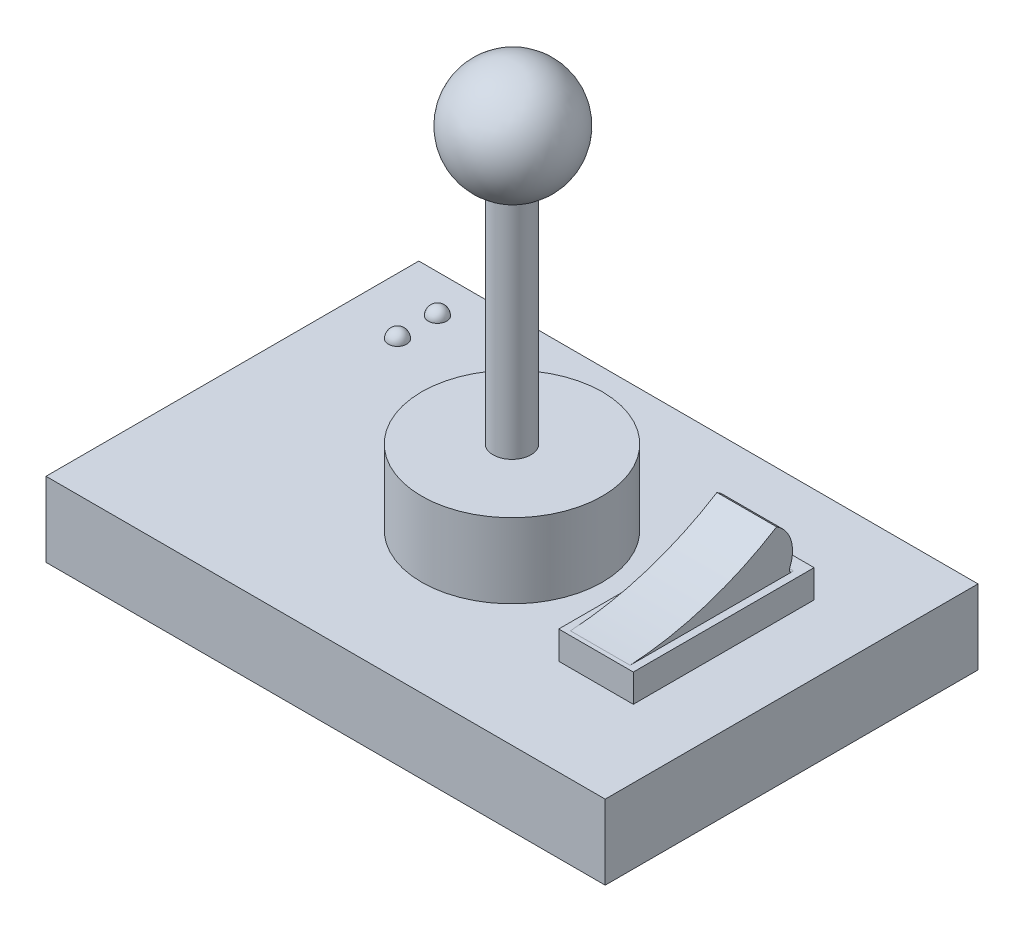
ISO-10303-21;
HEADER;
FILE_DESCRIPTION(('STEP AP214'),'2;1');
FILE_NAME('part.step','',(''),(''),'','','');
FILE_SCHEMA(('AUTOMOTIVE_DESIGN { 1 0 10303 214 1 1 1 1 }'));
ENDSEC;
DATA;
#1=APPLICATION_CONTEXT('core data for automotive mechanical design processes');
#2=APPLICATION_PROTOCOL_DEFINITION('international standard','automotive_design',2000,#1);
#3=PRODUCT_CONTEXT('',#1,'mechanical');
#4=PRODUCT('Part','Part','',(#3));
#5=PRODUCT_RELATED_PRODUCT_CATEGORY('part','',(#4));
#6=PRODUCT_DEFINITION_FORMATION('','',#4);
#7=PRODUCT_DEFINITION_CONTEXT('part definition',#1,'design');
#8=PRODUCT_DEFINITION('design','',#6,#7);
#9=PRODUCT_DEFINITION_SHAPE('','',#8);
#10=(LENGTH_UNIT() NAMED_UNIT(*) SI_UNIT(.MILLI.,.METRE.));
#11=(NAMED_UNIT(*) PLANE_ANGLE_UNIT() SI_UNIT($,.RADIAN.));
#12=(NAMED_UNIT(*) SI_UNIT($,.STERADIAN.) SOLID_ANGLE_UNIT());
#13=UNCERTAINTY_MEASURE_WITH_UNIT(LENGTH_MEASURE(1.E-05),#10,'distance_accuracy_value','');
#14=(GEOMETRIC_REPRESENTATION_CONTEXT(3) GLOBAL_UNCERTAINTY_ASSIGNED_CONTEXT((#13)) GLOBAL_UNIT_ASSIGNED_CONTEXT((#10,
#11,#12)) REPRESENTATION_CONTEXT('',''));
#15=CARTESIAN_POINT('',(0.,0.,0.));
#16=DIRECTION('',(0.,0.,1.));
#17=DIRECTION('',(1.,0.,0.));
#18=AXIS2_PLACEMENT_3D('',#15,#16,#17);
#19=CARTESIAN_POINT('',(0.,20.,0.));
#20=DIRECTION('',(0.,1.,0.));
#21=DIRECTION('',(0.,0.,1.));
#22=AXIS2_PLACEMENT_3D('',#19,#20,#21);
#23=PLANE('',#22);
#24=CARTESIAN_POINT('',(-59.7714063381106,20.,-29.0596155118016));
#25=DIRECTION('',(0.,1.,0.));
#26=DIRECTION('',(0.,0.,1.));
#27=AXIS2_PLACEMENT_3D('',#24,#25,#26);
#28=CIRCLE('',#27,2.48406479687552);
#29=CARTESIAN_POINT('',(-59.7714063381106,20.,-26.5755507149261));
#30=VERTEX_POINT('',#29);
#31=EDGE_CURVE('E52',#30,#30,#28,.F.);
#32=ORIENTED_EDGE('',*,*,#31,.T.);
#33=EDGE_LOOP('',(#32));
#34=FACE_BOUND('',#33,.T.);
#35=CARTESIAN_POINT('',(-59.7714063381106,20.,-39.76883352744));
#36=DIRECTION('',(0.,1.,0.));
#37=DIRECTION('',(0.,0.,1.));
#38=AXIS2_PLACEMENT_3D('',#35,#36,#37);
#39=CIRCLE('',#38,2.48406479687552);
#40=CARTESIAN_POINT('',(-59.7714063381106,20.,-37.2847687305645));
#41=VERTEX_POINT('',#40);
#42=EDGE_CURVE('E169',#41,#41,#39,.F.);
#43=ORIENTED_EDGE('',*,*,#42,.T.);
#44=EDGE_LOOP('',(#43));
#45=FACE_BOUND('',#44,.T.);
#46=CARTESIAN_POINT('',(0.,20.,0.));
#47=DIRECTION('',(0.,1.,0.));
#48=DIRECTION('',(0.,0.,1.));
#49=AXIS2_PLACEMENT_3D('',#46,#47,#48);
#50=CIRCLE('',#49,24.2391546507137);
#51=CARTESIAN_POINT('',(0.,20.,24.2391546507137));
#52=VERTEX_POINT('',#51);
#53=EDGE_CURVE('E326',#52,#52,#50,.F.);
#54=ORIENTED_EDGE('',*,*,#53,.T.);
#55=EDGE_LOOP('',(#54));
#56=FACE_BOUND('',#55,.T.);
#57=DIRECTION('',(0.,0.,1.));
#58=VECTOR('',#57,1.);
#59=CARTESIAN_POINT('',(-75.,20.,-50.));
#60=LINE('',#59,#58);
#61=CARTESIAN_POINT('',(-75.,20.,-50.));
#62=VERTEX_POINT('',#61);
#63=CARTESIAN_POINT('',(-75.,20.,50.));
#64=VERTEX_POINT('',#63);
#65=EDGE_CURVE('E340',#62,#64,#60,.T.);
#66=ORIENTED_EDGE('',*,*,#65,.T.);
#67=DIRECTION('',(1.,0.,0.));
#68=VECTOR('',#67,1.);
#69=CARTESIAN_POINT('',(-75.,20.,50.));
#70=LINE('',#69,#68);
#71=CARTESIAN_POINT('',(75.,20.,50.));
#72=VERTEX_POINT('',#71);
#73=EDGE_CURVE('E348',#64,#72,#70,.T.);
#74=ORIENTED_EDGE('',*,*,#73,.T.);
#75=DIRECTION('',(0.,0.,-1.));
#76=VECTOR('',#75,1.);
#77=CARTESIAN_POINT('',(75.,20.,-50.));
#78=LINE('',#77,#76);
#79=CARTESIAN_POINT('',(75.,20.,-50.));
#80=VERTEX_POINT('',#79);
#81=EDGE_CURVE('E352',#72,#80,#78,.T.);
#82=ORIENTED_EDGE('',*,*,#81,.T.);
#83=DIRECTION('',(-1.,0.,0.));
#84=VECTOR('',#83,1.);
#85=CARTESIAN_POINT('',(-75.,20.,-50.));
#86=LINE('',#85,#84);
#87=EDGE_CURVE('E334',#80,#62,#86,.T.);
#88=ORIENTED_EDGE('',*,*,#87,.T.);
#89=EDGE_LOOP('',(#66,#74,#82,#88));
#90=FACE_BOUND('',#89,.T.);
#91=DIRECTION('',(1.,0.,0.));
#92=VECTOR('',#91,1.);
#93=CARTESIAN_POINT('',(36.7473444831783,20.,24.2067764504516));
#94=LINE('',#93,#92);
#95=CARTESIAN_POINT('',(36.7473444831783,20.,24.2067764504516));
#96=VERTEX_POINT('',#95);
#97=CARTESIAN_POINT('',(56.7473444831783,20.,24.2067764504516));
#98=VERTEX_POINT('',#97);
#99=EDGE_CURVE('E379',#96,#98,#94,.T.);
#100=ORIENTED_EDGE('',*,*,#99,.F.);
#101=DIRECTION('',(0.,0.,1.));
#102=VECTOR('',#101,1.);
#103=CARTESIAN_POINT('',(36.7473444831783,20.,-24.2932235495484));
#104=LINE('',#103,#102);
#105=CARTESIAN_POINT('',(36.7473444831783,20.,-24.2932235495484));
#106=VERTEX_POINT('',#105);
#107=EDGE_CURVE('E381',#106,#96,#104,.T.);
#108=ORIENTED_EDGE('',*,*,#107,.F.);
#109=DIRECTION('',(-1.,0.,0.));
#110=VECTOR('',#109,1.);
#111=CARTESIAN_POINT('',(36.7473444831783,20.,-24.2932235495484));
#112=LINE('',#111,#110);
#113=CARTESIAN_POINT('',(56.7473444831783,20.,-24.2932235495484));
#114=VERTEX_POINT('',#113);
#115=EDGE_CURVE('E373',#114,#106,#112,.T.);
#116=ORIENTED_EDGE('',*,*,#115,.F.);
#117=DIRECTION('',(0.,0.,-1.));
#118=VECTOR('',#117,1.);
#119=CARTESIAN_POINT('',(56.7473444831783,20.,-24.2932235495484));
#120=LINE('',#119,#118);
#121=EDGE_CURVE('E376',#98,#114,#120,.T.);
#122=ORIENTED_EDGE('',*,*,#121,.F.);
#123=EDGE_LOOP('',(#100,#108,#116,#122));
#124=FACE_BOUND('',#123,.T.);
#125=ADVANCED_FACE('F44',(#34,#45,#56,#90,#124),#23,.T.);
#126=CARTESIAN_POINT('',(0.,100.,0.));
#127=DIRECTION('',(0.,-1.,0.));
#128=DIRECTION('',(0.,0.,-1.));
#129=AXIS2_PLACEMENT_3D('',#126,#127,#128);
#130=CYLINDRICAL_SURFACE('',#129,5.07390112110831);
#131=CARTESIAN_POINT('',(0.,40.,0.));
#132=DIRECTION('',(0.,1.,0.));
#133=DIRECTION('',(0.,0.,1.));
#134=AXIS2_PLACEMENT_3D('',#131,#132,#133);
#135=CIRCLE('',#134,5.07390112110831);
#136=CARTESIAN_POINT('',(0.,40.,5.07390112110831));
#137=VERTEX_POINT('',#136);
#138=EDGE_CURVE('E227',#137,#137,#135,.F.);
#139=ORIENTED_EDGE('',*,*,#138,.F.);
#140=EDGE_LOOP('',(#139));
#141=FACE_BOUND('',#140,.T.);
#142=CARTESIAN_POINT('',(-3.58601161184705,99.6185096445108,-3.58956728680245));
#143=CARTESIAN_POINT('',(-3.68687175268267,99.6201431007958,-3.48880849558666));
#144=CARTESIAN_POINT('',(-3.78346959181233,99.6218456039696,-3.38380799906421));
#145=CARTESIAN_POINT('',(-3.96751252370378,99.6253776556399,-3.16601387567986));
#146=CARTESIAN_POINT('',(-4.05495519847822,99.6272072374882,-3.05321820301226));
#147=CARTESIAN_POINT('',(-4.22010275951486,99.6309817569862,-2.82056304577515));
#148=CARTESIAN_POINT('',(-4.29779887927925,99.6329267962001,-2.7006973425312));
#149=CARTESIAN_POINT('',(-4.44283839587438,99.6369177988738,-2.45479975993668));
#150=CARTESIAN_POINT('',(-4.51017799522705,99.6389637989921,-2.32876564100565));
#151=CARTESIAN_POINT('',(-4.63393783645028,99.6431398299573,-2.07157934754588));
#152=CARTESIAN_POINT('',(-4.69036731073871,99.6452697879029,-1.94043161423496));
#153=CARTESIAN_POINT('',(-4.79199617398492,99.6496011331331,-1.67380040562698));
#154=CARTESIAN_POINT('',(-4.83719141496824,99.6518025464626,-1.53831534965615));
#155=CARTESIAN_POINT('',(-4.9159790891903,99.6562591037886,-1.26410422485947));
#156=CARTESIAN_POINT('',(-4.94957867242778,99.6585142137547,-1.12538020975776));
#157=CARTESIAN_POINT('',(-5.00498547174345,99.6630643632609,-0.845544205194316));
#158=CARTESIAN_POINT('',(-5.02678833088156,99.6653594172311,-0.704431353268987));
#159=CARTESIAN_POINT('',(-5.05842482158717,99.669971931634,-0.420897939488266));
#160=CARTESIAN_POINT('',(-5.06826073432763,99.6722893877113,-0.278477632080524));
#161=CARTESIAN_POINT('',(-5.07590250871906,99.6769315502863,0.00673796194253405));
#162=CARTESIAN_POINT('',(-5.07370392673301,99.6792562591453,0.149533367605019));
#163=CARTESIAN_POINT('',(-5.05728470044146,99.6838947746539,0.434384251114937));
#164=CARTESIAN_POINT('',(-5.04306801673115,99.6862085846428,0.576439957216208));
#165=CARTESIAN_POINT('',(-5.00271147121268,99.6908104518568,0.85890140627375));
#166=CARTESIAN_POINT('',(-4.9765672090689,99.693098499258,0.999306520665425));
#167=CARTESIAN_POINT('',(-4.91255067419148,99.6976308533971,1.27736601649463));
#168=CARTESIAN_POINT('',(-4.87468256497724,99.6998751753629,1.41502135602126));
#169=CARTESIAN_POINT('',(-4.78747058772202,99.7043056651591,1.68670184348221));
#170=CARTESIAN_POINT('',(-4.73812248776304,99.7064918112119,1.82072563231132));
#171=CARTESIAN_POINT('',(-4.62832005930795,99.71078880638,2.08409758655086));
#172=CARTESIAN_POINT('',(-4.56786985975261,99.7128996831411,2.21344746888403));
#173=CARTESIAN_POINT('',(-4.43629081072538,99.7170320391798,2.4666146026853));
#174=CARTESIAN_POINT('',(-4.36515802714082,99.7190534851659,2.59042979398307));
#175=CARTESIAN_POINT('',(-4.13650219649437,99.7249596534871,2.95211293445568));
#176=CARTESIAN_POINT('',(-3.96359641523021,99.7286910959837,3.18051812160724));
#177=CARTESIAN_POINT('',(-3.58197243964958,99.7356270564313,3.6049281424812));
#178=CARTESIAN_POINT('',(-3.37325433028268,99.7388315756323,3.80093305305735));
#179=CARTESIAN_POINT('',(-2.92586681367379,99.7446240420185,4.15513150009396));
#180=CARTESIAN_POINT('',(-2.68720085560756,99.7472120601086,4.31332938480849));
#181=CARTESIAN_POINT('',(-2.18669713679771,99.7516966256811,4.58740141141139));
#182=CARTESIAN_POINT('',(-1.92485936832683,99.7535931729329,4.70327553918567));
#183=CARTESIAN_POINT('',(-1.3854747214148,99.75664003726,4.88940805636402));
#184=CARTESIAN_POINT('',(-1.10792985974053,99.7577904499025,4.95967228762768));
#185=CARTESIAN_POINT('',(-0.544981794515749,99.7593121311575,5.05260884158343));
#186=CARTESIAN_POINT('',(-0.259578598546589,99.7596834005217,5.07528121018823));
#187=CARTESIAN_POINT('',(0.31095960339358,99.7596360736524,5.07239095342274));
#188=CARTESIAN_POINT('',(0.596094629728464,99.7592175432266,5.04683234675089));
#189=CARTESIAN_POINT('',(1.15802598483791,99.7576028480743,4.94821398714321));
#190=CARTESIAN_POINT('',(1.43482231373644,99.7564066833594,4.87515423491358));
#191=CARTESIAN_POINT('',(1.97221888152086,99.7532712837887,4.68360931697726));
#192=CARTESIAN_POINT('',(2.23281915210613,99.7513320503875,4.56512424018158));
#193=CARTESIAN_POINT('',(2.7304284148868,99.7467664859592,4.28609397743544));
#194=CARTESIAN_POINT('',(2.96743740030826,99.7441401547349,4.125548779408));
#195=CARTESIAN_POINT('',(3.41115719902546,99.7382758245097,3.76694267038221));
#196=CARTESIAN_POINT('',(3.6178655726645,99.7350377763043,3.56887874149938));
#197=CARTESIAN_POINT('',(3.99509702712315,99.7280432632931,3.14086721504558));
#198=CARTESIAN_POINT('',(4.16562008239599,99.7242867981212,2.91091959496496));
#199=CARTESIAN_POINT('',(4.46566336606378,99.7163626892163,2.42563700838792));
#200=CARTESIAN_POINT('',(4.59517838402273,99.7121949933209,2.17029882120576));
#201=CARTESIAN_POINT('',(4.80950251960433,99.7035680655002,1.64150750232241));
#202=CARTESIAN_POINT('',(4.89431161196478,99.6991088334102,1.36805436038501));
#203=CARTESIAN_POINT('',(5.01682617397341,99.6900255045677,0.810761404316948));
#204=CARTESIAN_POINT('',(5.05452613021363,99.6854013885832,0.526920378442909));
#205=CARTESIAN_POINT('',(5.08173410986365,99.6761203203773,-0.0430622457612098));
#206=CARTESIAN_POINT('',(5.07124209329043,99.6714633681288,-0.329203845999791));
#207=CARTESIAN_POINT('',(5.0023645878778,99.6622484872234,-0.89567932443103));
#208=CARTESIAN_POINT('',(4.94397640439181,99.6576905641528,-1.17601287495201));
#209=CARTESIAN_POINT('',(4.78094829502334,99.6488027958474,-1.72290587828733));
#210=CARTESIAN_POINT('',(4.6763084193486,99.644472950365,-1.98946534605354));
#211=CARTESIAN_POINT('',(4.42379068882093,99.6361641304893,-2.50120125987774));
#212=CARTESIAN_POINT('',(4.27591411404985,99.6321851457128,-2.74637833871176));
#213=CARTESIAN_POINT('',(3.94096309657253,99.6246878538731,-3.20852042217139));
#214=CARTESIAN_POINT('',(3.75388860149279,99.6211695474254,-3.42548538910134));
#215=CARTESIAN_POINT('',(3.44819380860763,99.61631575437,-3.72490087392714));
#216=CARTESIAN_POINT('',(3.34205743391786,99.6147677862755,-3.82040739204841));
#217=CARTESIAN_POINT('',(3.1221290880893,99.6118227695874,-4.0021358633288));
#218=CARTESIAN_POINT('',(3.00833995839066,99.6104256654752,-4.08836123195835));
#219=CARTESIAN_POINT('',(2.77386480153252,99.6077917068032,-4.25094320381142));
#220=CARTESIAN_POINT('',(2.65317623249743,99.6065549118596,-4.32729613562094));
#221=CARTESIAN_POINT('',(2.40583713873899,99.6042510973497,-4.46953704809989));
#222=CARTESIAN_POINT('',(2.27918883192778,99.6031840152624,-4.53542888255016));
#223=CARTESIAN_POINT('',(2.02075761936959,99.6012263438165,-4.65632562162671));
#224=CARTESIAN_POINT('',(1.88897338887605,99.6003358003591,-4.71132769483336));
#225=CARTESIAN_POINT('',(1.62128758297268,99.5987380723651,-4.81001455611312));
#226=CARTESIAN_POINT('',(1.48538754594211,99.598030820241,-4.85370351581243));
#227=CARTESIAN_POINT('',(1.21034442113455,99.5968039931488,-4.92949225607468));
#228=CARTESIAN_POINT('',(1.07120027965252,99.5962844800897,-4.96158821372204));
#229=CARTESIAN_POINT('',(0.790753788636147,99.595437248899,-5.01393269485669));
#230=CARTESIAN_POINT('',(0.649452254937331,99.5951094600227,-5.03418558834793));
#231=CARTESIAN_POINT('',(0.365621759326076,99.594647632922,-5.06272062559922));
#232=CARTESIAN_POINT('',(0.223092599467788,99.594513626555,-5.07100080106753));
#233=CARTESIAN_POINT('',(-0.0621039471469259,99.5944404166088,-5.07552436786089));
#234=CARTESIAN_POINT('',(-0.204771263486815,99.5945011411625,-5.07177219982455));
#235=CARTESIAN_POINT('',(-0.489371009010804,99.5948169096283,-5.05226142617352));
#236=CARTESIAN_POINT('',(-0.631302929776499,99.5950720735575,-5.03649540504196));
#237=CARTESIAN_POINT('',(-0.913281009654119,99.5957749471684,-4.99306843412208));
#238=CARTESIAN_POINT('',(-1.05332784445368,99.596222585856,-4.96541187014173));
#239=CARTESIAN_POINT('',(-1.3307072660641,99.5973077125712,-4.89837375973215));
#240=CARTESIAN_POINT('',(-1.46803754100859,99.5979453554612,-4.85898264909522));
#241=CARTESIAN_POINT('',(-1.73883780098327,99.5994056136238,-4.76878141585154));
#242=CARTESIAN_POINT('',(-1.8723091788542,99.6002281611916,-4.71797547291945));
#243=CARTESIAN_POINT('',(-2.13437996498477,99.6020518164495,-4.60534649252495));
#244=CARTESIAN_POINT('',(-2.26298360879523,99.6030527643669,-4.54353331303294));
#245=CARTESIAN_POINT('',(-2.51448915196939,99.6052263103334,-4.40932345819229));
#246=CARTESIAN_POINT('',(-2.63739254235664,99.6063988631584,-4.33692957125722));
#247=CARTESIAN_POINT('',(-2.90642981250973,99.6092198306177,-4.16278651327073));
#248=CARTESIAN_POINT('',(-3.05074633594714,99.6109140875207,-4.05821313964566));
#249=CARTESIAN_POINT('',(-3.32759252235291,99.6145395884219,-3.83448498937437));
#250=CARTESIAN_POINT('',(-3.46012218542245,99.6164708324181,-3.71533021285332));
#251=CARTESIAN_POINT('',(-3.58601161184705,99.6185096445108,-3.58956728680245));
#252=B_SPLINE_CURVE_WITH_KNOTS('',3,(#142,#143,#144,#145,#146,#147,#148,#149,#150,#151,#152,
#153,#154,#155,#156,#157,#158,#159,#160,#161,#162,#163,#164,#165,#166,#167,#168,#169,#170,#171,
#172,#173,#174,#175,#176,#177,#178,#179,#180,#181,#182,#183,#184,#185,#186,#187,#188,#189,#190,
#191,#192,#193,#194,#195,#196,#197,#198,#199,#200,#201,#202,#203,#204,#205,#206,#207,#208,#209,
#210,#211,#212,#213,#214,#215,#216,#217,#218,#219,#220,#221,#222,#223,#224,#225,#226,#227,#228,
#229,#230,#231,#232,#233,#234,#235,#236,#237,#238,#239,#240,#241,#242,#243,#244,#245,#246,#247,
#248,#249,#250,#251),.UNSPECIFIED.,.T.,.F.,(4,2,2,2,2,2,2,2,2,2,2,2,2,2,2,2,2,2,2,2,2,2,2,2,2,2,
2,2,2,2,2,2,2,2,2,2,2,2,2,2,2,2,2,2,2,2,2,2,2,2,2,2,2,2,4),(0.,0.427570992025448,
0.855254627250629,1.28332022379979,1.71154240902808,2.13940062058382,2.56741657476938,
2.99516813650237,3.42307757409522,3.85090542960255,4.27889126763909,4.70673611684238,
5.13473893484442,5.56258992914157,5.990598894607,6.41844900200093,6.84645706340693,
7.70151097712757,8.55656286262333,9.41151635968564,10.2664701418567,11.1213143972283,
11.9761578279162,12.8309300345359,13.6857022284479,14.5404727493225,15.3952435156325,
16.2500830661364,17.1049232201535,17.9598719456728,18.8148211543017,19.6698704123652,
20.5249203798305,21.3800184558536,22.2351156036418,23.0901874376677,23.9452604141877,
24.3732124443687,24.8010064455196,25.22895908218,25.6567536969998,26.0846593959773,
26.5124070825053,26.9402956948764,27.3680263196901,27.7958272546018,28.2234703241162,
28.6513775691365,29.0791271164694,29.5072262581439,29.9351689010302,30.3627301928795,
30.7901790087781,31.3238553149775,31.8575316165959),.UNSPECIFIED.);
#253=CARTESIAN_POINT('',(-3.58601161184705,99.6185096445108,-3.58956728680245));
#254=VERTEX_POINT('',#253);
#255=EDGE_CURVE('E219',#254,#254,#252,.T.);
#256=ORIENTED_EDGE('',*,*,#255,.F.);
#257=EDGE_LOOP('',(#256));
#258=FACE_BOUND('',#257,.T.);
#259=ADVANCED_FACE('F215',(#141,#258),#130,.T.);
#260=CARTESIAN_POINT('',(-75.,20.,-50.));
#261=DIRECTION('',(1.,0.,0.));
#262=DIRECTION('',(0.,0.,-1.));
#263=AXIS2_PLACEMENT_3D('',#260,#261,#262);
#264=PLANE('',#263);
#265=DIRECTION('',(0.,0.,1.));
#266=VECTOR('',#265,1.);
#267=CARTESIAN_POINT('',(-75.,0.,-50.));
#268=LINE('',#267,#266);
#269=CARTESIAN_POINT('',(-75.,0.,-50.));
#270=VERTEX_POINT('',#269);
#271=CARTESIAN_POINT('',(-75.,0.,50.));
#272=VERTEX_POINT('',#271);
#273=EDGE_CURVE('E319',#270,#272,#268,.T.);
#274=ORIENTED_EDGE('',*,*,#273,.T.);
#275=DIRECTION('',(0.,-1.,0.));
#276=VECTOR('',#275,1.);
#277=CARTESIAN_POINT('',(-75.,20.,50.));
#278=LINE('',#277,#276);
#279=EDGE_CURVE('E226',#64,#272,#278,.T.);
#280=ORIENTED_EDGE('',*,*,#279,.F.);
#281=ORIENTED_EDGE('',*,*,#65,.F.);
#282=DIRECTION('',(0.,-1.,0.));
#283=VECTOR('',#282,1.);
#284=CARTESIAN_POINT('',(-75.,20.,-50.));
#285=LINE('',#284,#283);
#286=EDGE_CURVE('E323',#62,#270,#285,.T.);
#287=ORIENTED_EDGE('',*,*,#286,.T.);
#288=EDGE_LOOP('',(#274,#280,#281,#287));
#289=FACE_BOUND('',#288,.T.);
#290=ADVANCED_FACE('F291',(#289),#264,.F.);
#291=CARTESIAN_POINT('',(-75.,20.,50.));
#292=DIRECTION('',(0.,0.,-1.));
#293=DIRECTION('',(-1.,0.,0.));
#294=AXIS2_PLACEMENT_3D('',#291,#292,#293);
#295=PLANE('',#294);
#296=DIRECTION('',(1.,0.,0.));
#297=VECTOR('',#296,1.);
#298=CARTESIAN_POINT('',(-75.,0.,50.));
#299=LINE('',#298,#297);
#300=CARTESIAN_POINT('',(75.,0.,50.));
#301=VERTEX_POINT('',#300);
#302=EDGE_CURVE('E325',#272,#301,#299,.T.);
#303=ORIENTED_EDGE('',*,*,#302,.T.);
#304=DIRECTION('',(0.,-1.,0.));
#305=VECTOR('',#304,1.);
#306=CARTESIAN_POINT('',(75.,20.,50.));
#307=LINE('',#306,#305);
#308=EDGE_CURVE('E345',#72,#301,#307,.T.);
#309=ORIENTED_EDGE('',*,*,#308,.F.);
#310=ORIENTED_EDGE('',*,*,#73,.F.);
#311=ORIENTED_EDGE('',*,*,#279,.T.);
#312=EDGE_LOOP('',(#303,#309,#310,#311));
#313=FACE_BOUND('',#312,.T.);
#314=ADVANCED_FACE('F307',(#313),#295,.F.);
#315=CARTESIAN_POINT('',(75.,20.,-50.));
#316=DIRECTION('',(-1.,0.,0.));
#317=DIRECTION('',(0.,0.,1.));
#318=AXIS2_PLACEMENT_3D('',#315,#316,#317);
#319=PLANE('',#318);
#320=DIRECTION('',(0.,0.,-1.));
#321=VECTOR('',#320,1.);
#322=CARTESIAN_POINT('',(75.,0.,-50.));
#323=LINE('',#322,#321);
#324=CARTESIAN_POINT('',(75.,0.,-50.));
#325=VERTEX_POINT('',#324);
#326=EDGE_CURVE('E328',#301,#325,#323,.T.);
#327=ORIENTED_EDGE('',*,*,#326,.T.);
#328=DIRECTION('',(0.,-1.,0.));
#329=VECTOR('',#328,1.);
#330=CARTESIAN_POINT('',(75.,20.,-50.));
#331=LINE('',#330,#329);
#332=EDGE_CURVE('E342',#80,#325,#331,.T.);
#333=ORIENTED_EDGE('',*,*,#332,.F.);
#334=ORIENTED_EDGE('',*,*,#81,.F.);
#335=ORIENTED_EDGE('',*,*,#308,.T.);
#336=EDGE_LOOP('',(#327,#333,#334,#335));
#337=FACE_BOUND('',#336,.T.);
#338=ADVANCED_FACE('F303',(#337),#319,.F.);
#339=CARTESIAN_POINT('',(-75.,20.,-50.));
#340=DIRECTION('',(0.,0.,1.));
#341=DIRECTION('',(1.,0.,0.));
#342=AXIS2_PLACEMENT_3D('',#339,#340,#341);
#343=PLANE('',#342);
#344=DIRECTION('',(-1.,0.,0.));
#345=VECTOR('',#344,1.);
#346=CARTESIAN_POINT('',(-75.,0.,-50.));
#347=LINE('',#346,#345);
#348=EDGE_CURVE('E338',#325,#270,#347,.T.);
#349=ORIENTED_EDGE('',*,*,#348,.T.);
#350=ORIENTED_EDGE('',*,*,#286,.F.);
#351=ORIENTED_EDGE('',*,*,#87,.F.);
#352=ORIENTED_EDGE('',*,*,#332,.T.);
#353=EDGE_LOOP('',(#349,#350,#351,#352));
#354=FACE_BOUND('',#353,.T.);
#355=ADVANCED_FACE('F299',(#354),#343,.F.);
#356=CARTESIAN_POINT('',(0.,0.,0.));
#357=DIRECTION('',(0.,1.,0.));
#358=DIRECTION('',(0.,0.,1.));
#359=AXIS2_PLACEMENT_3D('',#356,#357,#358);
#360=PLANE('',#359);
#361=ORIENTED_EDGE('',*,*,#273,.F.);
#362=ORIENTED_EDGE('',*,*,#348,.F.);
#363=ORIENTED_EDGE('',*,*,#326,.F.);
#364=ORIENTED_EDGE('',*,*,#302,.F.);
#365=EDGE_LOOP('',(#361,#362,#363,#364));
#366=FACE_BOUND('',#365,.T.);
#367=ADVANCED_FACE('F296',(#366),#360,.F.);
#368=CARTESIAN_POINT('',(0.,40.,0.));
#369=DIRECTION('',(0.,-1.,0.));
#370=DIRECTION('',(0.,0.,-1.));
#371=AXIS2_PLACEMENT_3D('',#368,#369,#370);
#372=CYLINDRICAL_SURFACE('',#371,24.2391546507137);
#373=ORIENTED_EDGE('',*,*,#53,.F.);
#374=EDGE_LOOP('',(#373));
#375=FACE_BOUND('',#374,.T.);
#376=CARTESIAN_POINT('',(0.,40.,0.));
#377=DIRECTION('',(0.,1.,0.));
#378=DIRECTION('',(0.,0.,1.));
#379=AXIS2_PLACEMENT_3D('',#376,#377,#378);
#380=CIRCLE('',#379,24.2391546507137);
#381=CARTESIAN_POINT('',(0.,40.,24.2391546507137));
#382=VERTEX_POINT('',#381);
#383=EDGE_CURVE('E331',#382,#382,#380,.T.);
#384=ORIENTED_EDGE('',*,*,#383,.F.);
#385=EDGE_LOOP('',(#384));
#386=FACE_BOUND('',#385,.T.);
#387=ADVANCED_FACE('F295',(#375,#386),#372,.T.);
#388=CARTESIAN_POINT('',(0.,40.,0.));
#389=DIRECTION('',(0.,1.,0.));
#390=DIRECTION('',(0.,0.,1.));
#391=AXIS2_PLACEMENT_3D('',#388,#389,#390);
#392=PLANE('',#391);
#393=ORIENTED_EDGE('',*,*,#138,.T.);
#394=EDGE_LOOP('',(#393));
#395=FACE_BOUND('',#394,.T.);
#396=ORIENTED_EDGE('',*,*,#383,.T.);
#397=EDGE_LOOP('',(#396));
#398=FACE_BOUND('',#397,.T.);
#399=ADVANCED_FACE('F213',(#395,#398),#392,.T.);
#400=CARTESIAN_POINT('',(0.,113.790742156471,-0.229753847543469));
#401=DIRECTION('',(0.,-1.,0.));
#402=DIRECTION('',(0.,0.,1.));
#403=AXIS2_PLACEMENT_3D('',#400,#401,#402);
#404=SPHERICAL_SURFACE('',#403,15.);
#405=ORIENTED_EDGE('',*,*,#255,.T.);
#406=EDGE_LOOP('',(#405));
#407=FACE_BOUND('',#406,.T.);
#408=ADVANCED_FACE('F208',(#407),#404,.T.);
#409=CARTESIAN_POINT('',(36.7473444831783,27.5,-24.2932235495484));
#410=DIRECTION('',(1.,0.,0.));
#411=DIRECTION('',(0.,0.,-1.));
#412=AXIS2_PLACEMENT_3D('',#409,#410,#411);
#413=PLANE('',#412);
#414=ORIENTED_EDGE('',*,*,#107,.T.);
#415=DIRECTION('',(0.,-1.,0.));
#416=VECTOR('',#415,1.);
#417=CARTESIAN_POINT('',(36.7473444831783,27.5,24.2067764504516));
#418=LINE('',#417,#416);
#419=CARTESIAN_POINT('',(36.7473444831783,27.5,24.2067764504516));
#420=VERTEX_POINT('',#419);
#421=EDGE_CURVE('E362',#420,#96,#418,.T.);
#422=ORIENTED_EDGE('',*,*,#421,.F.);
#423=DIRECTION('',(0.,0.,1.));
#424=VECTOR('',#423,1.);
#425=CARTESIAN_POINT('',(36.7473444831783,27.5,-24.2932235495484));
#426=LINE('',#425,#424);
#427=CARTESIAN_POINT('',(36.7473444831783,27.5,-24.2932235495484));
#428=VERTEX_POINT('',#427);
#429=EDGE_CURVE('E375',#428,#420,#426,.T.);
#430=ORIENTED_EDGE('',*,*,#429,.F.);
#431=DIRECTION('',(0.,-1.,0.));
#432=VECTOR('',#431,1.);
#433=CARTESIAN_POINT('',(36.7473444831783,27.5,-24.2932235495484));
#434=LINE('',#433,#432);
#435=EDGE_CURVE('E369',#428,#106,#434,.T.);
#436=ORIENTED_EDGE('',*,*,#435,.T.);
#437=EDGE_LOOP('',(#414,#422,#430,#436));
#438=FACE_BOUND('',#437,.T.);
#439=ADVANCED_FACE('F204',(#438),#413,.F.);
#440=CARTESIAN_POINT('',(36.7473444831783,27.5,24.2067764504516));
#441=DIRECTION('',(0.,0.,-1.));
#442=DIRECTION('',(-1.,0.,0.));
#443=AXIS2_PLACEMENT_3D('',#440,#441,#442);
#444=PLANE('',#443);
#445=ORIENTED_EDGE('',*,*,#99,.T.);
#446=DIRECTION('',(0.,-1.,0.));
#447=VECTOR('',#446,1.);
#448=CARTESIAN_POINT('',(56.7473444831783,27.5,24.2067764504516));
#449=LINE('',#448,#447);
#450=CARTESIAN_POINT('',(56.7473444831783,27.5,24.2067764504516));
#451=VERTEX_POINT('',#450);
#452=EDGE_CURVE('E364',#451,#98,#449,.T.);
#453=ORIENTED_EDGE('',*,*,#452,.F.);
#454=DIRECTION('',(1.,0.,0.));
#455=VECTOR('',#454,1.);
#456=CARTESIAN_POINT('',(36.7473444831783,27.5,24.2067764504516));
#457=LINE('',#456,#455);
#458=EDGE_CURVE('E387',#420,#451,#457,.T.);
#459=ORIENTED_EDGE('',*,*,#458,.F.);
#460=ORIENTED_EDGE('',*,*,#421,.T.);
#461=EDGE_LOOP('',(#445,#453,#459,#460));
#462=FACE_BOUND('',#461,.T.);
#463=ADVANCED_FACE('F200',(#462),#444,.F.);
#464=CARTESIAN_POINT('',(56.7473444831783,27.5,-24.2932235495484));
#465=DIRECTION('',(-1.,0.,0.));
#466=DIRECTION('',(0.,0.,1.));
#467=AXIS2_PLACEMENT_3D('',#464,#465,#466);
#468=PLANE('',#467);
#469=ORIENTED_EDGE('',*,*,#121,.T.);
#470=DIRECTION('',(0.,-1.,0.));
#471=VECTOR('',#470,1.);
#472=CARTESIAN_POINT('',(56.7473444831783,27.5,-24.2932235495484));
#473=LINE('',#472,#471);
#474=CARTESIAN_POINT('',(56.7473444831783,27.5,-24.2932235495484));
#475=VERTEX_POINT('',#474);
#476=EDGE_CURVE('E367',#475,#114,#473,.T.);
#477=ORIENTED_EDGE('',*,*,#476,.F.);
#478=DIRECTION('',(0.,0.,-1.));
#479=VECTOR('',#478,1.);
#480=CARTESIAN_POINT('',(56.7473444831783,27.5,-24.2932235495484));
#481=LINE('',#480,#479);
#482=EDGE_CURVE('E385',#451,#475,#481,.T.);
#483=ORIENTED_EDGE('',*,*,#482,.F.);
#484=ORIENTED_EDGE('',*,*,#452,.T.);
#485=EDGE_LOOP('',(#469,#477,#483,#484));
#486=FACE_BOUND('',#485,.T.);
#487=ADVANCED_FACE('F196',(#486),#468,.F.);
#488=CARTESIAN_POINT('',(36.7473444831783,27.5,-24.2932235495484));
#489=DIRECTION('',(0.,0.,1.));
#490=DIRECTION('',(1.,0.,0.));
#491=AXIS2_PLACEMENT_3D('',#488,#489,#490);
#492=PLANE('',#491);
#493=ORIENTED_EDGE('',*,*,#115,.T.);
#494=ORIENTED_EDGE('',*,*,#435,.F.);
#495=DIRECTION('',(-1.,0.,0.));
#496=VECTOR('',#495,1.);
#497=CARTESIAN_POINT('',(36.7473444831783,27.5,-24.2932235495484));
#498=LINE('',#497,#496);
#499=EDGE_CURVE('E372',#475,#428,#498,.T.);
#500=ORIENTED_EDGE('',*,*,#499,.F.);
#501=ORIENTED_EDGE('',*,*,#476,.T.);
#502=EDGE_LOOP('',(#493,#494,#500,#501));
#503=FACE_BOUND('',#502,.T.);
#504=ADVANCED_FACE('F192',(#503),#492,.F.);
#505=CARTESIAN_POINT('',(0.,27.5,0.));
#506=DIRECTION('',(0.,1.,0.));
#507=DIRECTION('',(0.,0.,1.));
#508=AXIS2_PLACEMENT_3D('',#505,#506,#507);
#509=PLANE('',#508);
#510=CARTESIAN_POINT('',(55.5473444831783,27.5,-20.7631659821556));
#511=CARTESIAN_POINT('',(49.6806778165116,27.5,-20.7631659821556));
#512=CARTESIAN_POINT('',(43.8140111498507,27.5,-20.7631659821556));
#513=CARTESIAN_POINT('',(37.9473444831783,27.5,-20.7631659821556));
#514=B_SPLINE_CURVE_WITH_KNOTS('',3,(#510,#511,#512,#513),.UNSPECIFIED.,.F.,.F.,(4,4),
(-0.000799999999999999,0.0168),.UNSPECIFIED.);
#515=CARTESIAN_POINT('',(38.7473444831783,27.5,-20.7631659821556));
#516=VERTEX_POINT('',#515);
#517=CARTESIAN_POINT('',(54.7473444831786,27.5,-20.7631659821556));
#518=VERTEX_POINT('',#517);
#519=EDGE_CURVE('E225',#516,#518,#514,.F.);
#520=ORIENTED_EDGE('',*,*,#519,.T.);
#521=DIRECTION('',(0.,0.,-1.));
#522=VECTOR('',#521,1.);
#523=CARTESIAN_POINT('',(54.7473444831783,27.5,-19.1343286258308));
#524=LINE('',#523,#522);
#525=CARTESIAN_POINT('',(54.7473444831783,27.5,23.0636996829206));
#526=VERTEX_POINT('',#525);
#527=EDGE_CURVE('E146',#526,#518,#524,.T.);
#528=ORIENTED_EDGE('',*,*,#527,.F.);
#529=DIRECTION('',(1.,0.,0.));
#530=VECTOR('',#529,1.);
#531=CARTESIAN_POINT('',(38.7473444831783,27.5,23.0636996829206));
#532=LINE('',#531,#530);
#533=CARTESIAN_POINT('',(38.7473444831783,27.5,23.0636996829206));
#534=VERTEX_POINT('',#533);
#535=EDGE_CURVE('E153',#534,#526,#532,.T.);
#536=ORIENTED_EDGE('',*,*,#535,.F.);
#537=DIRECTION('',(0.,0.,-1.));
#538=VECTOR('',#537,1.);
#539=CARTESIAN_POINT('',(38.7473444831783,27.5,-19.1343286258308));
#540=LINE('',#539,#538);
#541=EDGE_CURVE('E154',#534,#516,#540,.T.);
#542=ORIENTED_EDGE('',*,*,#541,.T.);
#543=EDGE_LOOP('',(#520,#528,#536,#542));
#544=FACE_BOUND('',#543,.T.);
#545=ORIENTED_EDGE('',*,*,#429,.T.);
#546=ORIENTED_EDGE('',*,*,#458,.T.);
#547=ORIENTED_EDGE('',*,*,#482,.T.);
#548=ORIENTED_EDGE('',*,*,#499,.T.);
#549=EDGE_LOOP('',(#545,#546,#547,#548));
#550=FACE_BOUND('',#549,.T.);
#551=ADVANCED_FACE('F187',(#544,#550),#509,.T.);
#552=CARTESIAN_POINT('',(38.7473444831783,32.2978411310754,-11.4321697569062));
#553=DIRECTION('',(1.,0.,0.));
#554=DIRECTION('',(0.,0.,-1.));
#555=AXIS2_PLACEMENT_3D('',#552,#553,#554);
#556=CYLINDRICAL_SURFACE('',#555,9.07427852565663);
#557=CARTESIAN_POINT('',(54.7473444831783,32.2978411310754,-11.4321697569062));
#558=DIRECTION('',(1.,0.,0.));
#559=DIRECTION('',(0.,0.,-1.));
#560=AXIS2_PLACEMENT_3D('',#557,#558,#559);
#561=CIRCLE('',#560,9.07427852565663);
#562=CARTESIAN_POINT('',(54.7473444831783,28.8769839320407,-19.8369461837367));
#563=VERTEX_POINT('',#562);
#564=CARTESIAN_POINT('',(54.7473444831783,40.,-16.2300108879815));
#565=VERTEX_POINT('',#564);
#566=EDGE_CURVE('E167',#563,#565,#561,.T.);
#567=ORIENTED_EDGE('',*,*,#566,.F.);
#568=CARTESIAN_POINT('',(37.9473444831783,28.8769839320407,-19.8369461837367));
#569=CARTESIAN_POINT('',(43.8140111498507,28.8769839320407,-19.8369461837367));
#570=CARTESIAN_POINT('',(49.6806778165116,28.8769839320407,-19.8369461837367));
#571=CARTESIAN_POINT('',(55.5473444831783,28.8769839320407,-19.8369461837367));
#572=B_SPLINE_CURVE_WITH_KNOTS('',3,(#568,#569,#570,#571),.UNSPECIFIED.,.F.,.F.,(4,4),(-0.0008,
0.0168),.UNSPECIFIED.);
#573=CARTESIAN_POINT('',(38.7473444831783,28.8769839320407,-19.8369461837367));
#574=VERTEX_POINT('',#573);
#575=EDGE_CURVE('E64',#563,#574,#572,.F.);
#576=ORIENTED_EDGE('',*,*,#575,.T.);
#577=CARTESIAN_POINT('',(38.7473444831783,32.2978411310754,-11.4321697569062));
#578=DIRECTION('',(1.,0.,0.));
#579=DIRECTION('',(0.,0.,-1.));
#580=AXIS2_PLACEMENT_3D('',#577,#578,#579);
#581=CIRCLE('',#580,9.07427852565663);
#582=CARTESIAN_POINT('',(38.7473444831783,40.,-16.2300108879815));
#583=VERTEX_POINT('',#582);
#584=EDGE_CURVE('E137',#574,#583,#581,.T.);
#585=ORIENTED_EDGE('',*,*,#584,.T.);
#586=DIRECTION('',(1.,0.,0.));
#587=VECTOR('',#586,1.);
#588=CARTESIAN_POINT('',(38.7473444831783,40.,-16.2300108879815));
#589=LINE('',#588,#587);
#590=EDGE_CURVE('E140',#583,#565,#589,.T.);
#591=ORIENTED_EDGE('',*,*,#590,.T.);
#592=EDGE_LOOP('',(#567,#576,#585,#591));
#593=FACE_BOUND('',#592,.T.);
#594=ADVANCED_FACE('F139',(#593),#556,.T.);
#595=CARTESIAN_POINT('',(38.7473444831783,111.024440978362,27.9991629974549));
#596=DIRECTION('',(1.,0.,0.));
#597=DIRECTION('',(0.,0.,-1.));
#598=AXIS2_PLACEMENT_3D('',#595,#596,#597);
#599=CYLINDRICAL_SURFACE('',#598,83.6701322986705);
#600=CARTESIAN_POINT('',(54.7473444831783,111.024440978362,27.9991629974549));
#601=DIRECTION('',(-1.,0.,0.));
#602=DIRECTION('',(0.,0.,1.));
#603=AXIS2_PLACEMENT_3D('',#600,#601,#602);
#604=CIRCLE('',#603,83.6701322986705);
#605=EDGE_CURVE('E152',#565,#526,#604,.T.);
#606=ORIENTED_EDGE('',*,*,#605,.F.);
#607=ORIENTED_EDGE('',*,*,#590,.F.);
#608=CARTESIAN_POINT('',(38.7473444831783,111.024440978362,27.9991629974549));
#609=DIRECTION('',(-1.,0.,0.));
#610=DIRECTION('',(0.,0.,1.));
#611=AXIS2_PLACEMENT_3D('',#608,#609,#610);
#612=CIRCLE('',#611,83.6701322986705);
#613=EDGE_CURVE('E145',#583,#534,#612,.T.);
#614=ORIENTED_EDGE('',*,*,#613,.T.);
#615=ORIENTED_EDGE('',*,*,#535,.T.);
#616=EDGE_LOOP('',(#606,#607,#614,#615));
#617=FACE_BOUND('',#616,.T.);
#618=ADVANCED_FACE('F149',(#617),#599,.F.);
#619=CARTESIAN_POINT('',(38.7473444831783,32.2978411310754,-11.4321697569062));
#620=DIRECTION('',(1.,0.,0.));
#621=DIRECTION('',(0.,0.,-1.));
#622=AXIS2_PLACEMENT_3D('',#619,#620,#621);
#623=PLANE('',#622);
#624=ORIENTED_EDGE('',*,*,#584,.F.);
#625=CARTESIAN_POINT('',(38.7473444831783,27.5,-20.7631659821556));
#626=CARTESIAN_POINT('',(38.7473444831783,27.5,-20.5318458878534));
#627=CARTESIAN_POINT('',(38.7473444831783,27.5,-20.3005257935513));
#628=CARTESIAN_POINT('',(38.7473444831783,27.6235441119157,-19.8108703779585));
#629=CARTESIAN_POINT('',(38.7473444831783,27.937534857068,-19.5856219377693));
#630=CARTESIAN_POINT('',(38.7473444831783,28.4679888063484,-19.6634585493385));
#631=CARTESIAN_POINT('',(38.7473444831783,28.6757389663717,-19.7550367723952));
#632=CARTESIAN_POINT('',(38.7473444831783,28.8769839320407,-19.8369461837367));
#633=B_SPLINE_CURVE_WITH_KNOTS('',5,(#625,#626,#627,#628,#629,#630,#631,#632),.UNSPECIFIED.,.F.,
.F.,(6,2,6),(0.,0.5,1.),.UNSPECIFIED.);
#634=EDGE_CURVE('E12',#574,#516,#633,.F.);
#635=ORIENTED_EDGE('',*,*,#634,.T.);
#636=ORIENTED_EDGE('',*,*,#541,.F.);
#637=ORIENTED_EDGE('',*,*,#613,.F.);
#638=EDGE_LOOP('',(#624,#635,#636,#637));
#639=FACE_BOUND('',#638,.T.);
#640=ADVANCED_FACE('F156',(#639),#623,.F.);
#641=CARTESIAN_POINT('',(54.7473444831783,32.2978411310754,-11.4321697569062));
#642=DIRECTION('',(1.,0.,0.));
#643=DIRECTION('',(0.,0.,-1.));
#644=AXIS2_PLACEMENT_3D('',#641,#642,#643);
#645=PLANE('',#644);
#646=ORIENTED_EDGE('',*,*,#527,.T.);
#647=CARTESIAN_POINT('',(54.7473444831783,28.8769839320407,-19.8369461837367));
#648=CARTESIAN_POINT('',(54.7473444831783,28.6757389663717,-19.7550367723952));
#649=CARTESIAN_POINT('',(54.7473444831783,28.4679888063484,-19.6634585493385));
#650=CARTESIAN_POINT('',(54.7473444831783,27.937534857068,-19.5856219377693));
#651=CARTESIAN_POINT('',(54.7473444831783,27.6235441119157,-19.8108703779585));
#652=CARTESIAN_POINT('',(54.7473444831783,27.5,-20.3005257935513));
#653=CARTESIAN_POINT('',(54.7473444831783,27.5,-20.5318458878534));
#654=CARTESIAN_POINT('',(54.7473444831783,27.5,-20.7631659821556));
#655=B_SPLINE_CURVE_WITH_KNOTS('',5,(#647,#648,#649,#650,#651,#652,#653,#654),.UNSPECIFIED.,.F.,
.F.,(6,2,6),(0.,0.5,1.),.UNSPECIFIED.);
#656=EDGE_CURVE('E57',#518,#563,#655,.F.);
#657=ORIENTED_EDGE('',*,*,#656,.T.);
#658=ORIENTED_EDGE('',*,*,#566,.T.);
#659=ORIENTED_EDGE('',*,*,#605,.T.);
#660=EDGE_LOOP('',(#646,#657,#658,#659));
#661=FACE_BOUND('',#660,.T.);
#662=ADVANCED_FACE('F390',(#661),#645,.T.);
#663=CARTESIAN_POINT('',(37.9473444831783,27.5,-20.7631659821556));
#664=CARTESIAN_POINT('',(43.8140111498507,27.5,-20.7631659821556));
#665=CARTESIAN_POINT('',(49.6806778165116,27.5,-20.7631659821556));
#666=CARTESIAN_POINT('',(55.5473444831783,27.5,-20.7631659821556));
#667=CARTESIAN_POINT('',(37.9473444831783,27.5,-20.5318458878534));
#668=CARTESIAN_POINT('',(43.8140111498507,27.5,-20.5318458878534));
#669=CARTESIAN_POINT('',(49.6806778165116,27.5,-20.5318458878534));
#670=CARTESIAN_POINT('',(55.5473444831783,27.5,-20.5318458878534));
#671=CARTESIAN_POINT('',(37.9473444831783,27.5,-20.3005257935513));
#672=CARTESIAN_POINT('',(43.8140111498507,27.5,-20.3005257935513));
#673=CARTESIAN_POINT('',(49.6806778165116,27.5,-20.3005257935513));
#674=CARTESIAN_POINT('',(55.5473444831783,27.5,-20.3005257935513));
#675=CARTESIAN_POINT('',(37.9473444831783,27.6235441119157,-19.8108703779585));
#676=CARTESIAN_POINT('',(43.8140111498507,27.6235441119157,-19.8108703779585));
#677=CARTESIAN_POINT('',(49.6806778165116,27.6235441119157,-19.8108703779585));
#678=CARTESIAN_POINT('',(55.5473444831783,27.6235441119157,-19.8108703779585));
#679=CARTESIAN_POINT('',(37.9473444831783,27.937534857068,-19.5856219377693));
#680=CARTESIAN_POINT('',(43.8140111498507,27.937534857068,-19.5856219377693));
#681=CARTESIAN_POINT('',(49.6806778165116,27.937534857068,-19.5856219377693));
#682=CARTESIAN_POINT('',(55.5473444831783,27.937534857068,-19.5856219377693));
#683=CARTESIAN_POINT('',(37.9473444831783,28.4679888063484,-19.6634585493385));
#684=CARTESIAN_POINT('',(43.8140111498507,28.4679888063484,-19.6634585493385));
#685=CARTESIAN_POINT('',(49.6806778165116,28.4679888063484,-19.6634585493385));
#686=CARTESIAN_POINT('',(55.5473444831783,28.4679888063484,-19.6634585493385));
#687=CARTESIAN_POINT('',(37.9473444831783,28.6757389663717,-19.7550367723952));
#688=CARTESIAN_POINT('',(43.8140111498507,28.6757389663717,-19.7550367723952));
#689=CARTESIAN_POINT('',(49.6806778165116,28.6757389663717,-19.7550367723952));
#690=CARTESIAN_POINT('',(55.5473444831783,28.6757389663717,-19.7550367723952));
#691=CARTESIAN_POINT('',(37.9473444831783,28.8769839320407,-19.8369461837367));
#692=CARTESIAN_POINT('',(43.8140111498507,28.8769839320407,-19.8369461837367));
#693=CARTESIAN_POINT('',(49.6806778165116,28.8769839320407,-19.8369461837367));
#694=CARTESIAN_POINT('',(55.5473444831783,28.8769839320407,-19.8369461837367));
#695=B_SPLINE_SURFACE_WITH_KNOTS('',5,3,((#663,#664,#665,#666),(#667,#668,#669,#670),(#671,#672,
#673,#674),(#675,#676,#677,#678),(#679,#680,#681,#682),(#683,#684,#685,#686),(#687,#688,#689,
#690),(#691,#692,#693,#694)),.UNSPECIFIED.,.F.,.F.,.F.,(6,2,6),(4,4),(0.,0.5,1.),(-0.0008,
0.0168),.UNSPECIFIED.);
#696=ORIENTED_EDGE('',*,*,#634,.F.);
#697=ORIENTED_EDGE('',*,*,#575,.F.);
#698=ORIENTED_EDGE('',*,*,#656,.F.);
#699=ORIENTED_EDGE('',*,*,#519,.F.);
#700=EDGE_LOOP('',(#696,#697,#698,#699));
#701=FACE_BOUND('',#700,.T.);
#702=ADVANCED_FACE('F47',(#701),#695,.T.);
#703=CARTESIAN_POINT('',(-59.7714063381106,20.,-39.76883352744));
#704=DIRECTION('',(-1.,0.,0.));
#705=DIRECTION('',(0.,0.,-1.));
#706=AXIS2_PLACEMENT_3D('',#703,#704,#705);
#707=SPHERICAL_SURFACE('',#706,2.48406479687552);
#708=CARTESIAN_POINT('',(-59.7714063381106,20.,-39.76883352744));
#709=DIRECTION('',(0.,1.,0.));
#710=DIRECTION('',(0.,0.,1.));
#711=AXIS2_PLACEMENT_3D('',#708,#709,#710);
#712=SPHERICAL_SURFACE('',#711,2.48406479687552);
#713=ORIENTED_EDGE('',*,*,#42,.F.);
#714=EDGE_LOOP('',(#713));
#715=FACE_BOUND('',#714,.T.);
#716=ADVANCED_FACE('F279',(#715),#712,.T.);
#717=CARTESIAN_POINT('',(-59.7714063381106,20.,-29.0596155118016));
#718=DIRECTION('',(-1.,0.,0.));
#719=DIRECTION('',(0.,0.,-1.));
#720=AXIS2_PLACEMENT_3D('',#717,#718,#719);
#721=SPHERICAL_SURFACE('',#720,2.48406479687552);
#722=CARTESIAN_POINT('',(-59.7714063381106,20.,-29.0596155118016));
#723=DIRECTION('',(0.,1.,0.));
#724=DIRECTION('',(0.,0.,1.));
#725=AXIS2_PLACEMENT_3D('',#722,#723,#724);
#726=SPHERICAL_SURFACE('',#725,2.48406479687552);
#727=ORIENTED_EDGE('',*,*,#31,.F.);
#728=EDGE_LOOP('',(#727));
#729=FACE_BOUND('',#728,.T.);
#730=ADVANCED_FACE('F277',(#729),#726,.T.);
#731=CLOSED_SHELL('',(#125,#259,#290,#314,#338,#355,#367,#387,#399,#408,#439,#463,#487,#504,
#551,#594,#618,#640,#662,#702,#716,#730));
#732=MANIFOLD_SOLID_BREP('B2',#731);
#733=ADVANCED_BREP_SHAPE_REPRESENTATION('',(#18,#732),#14);
#734=SHAPE_DEFINITION_REPRESENTATION(#9,#733);
ENDSEC;
END-ISO-10303-21;
